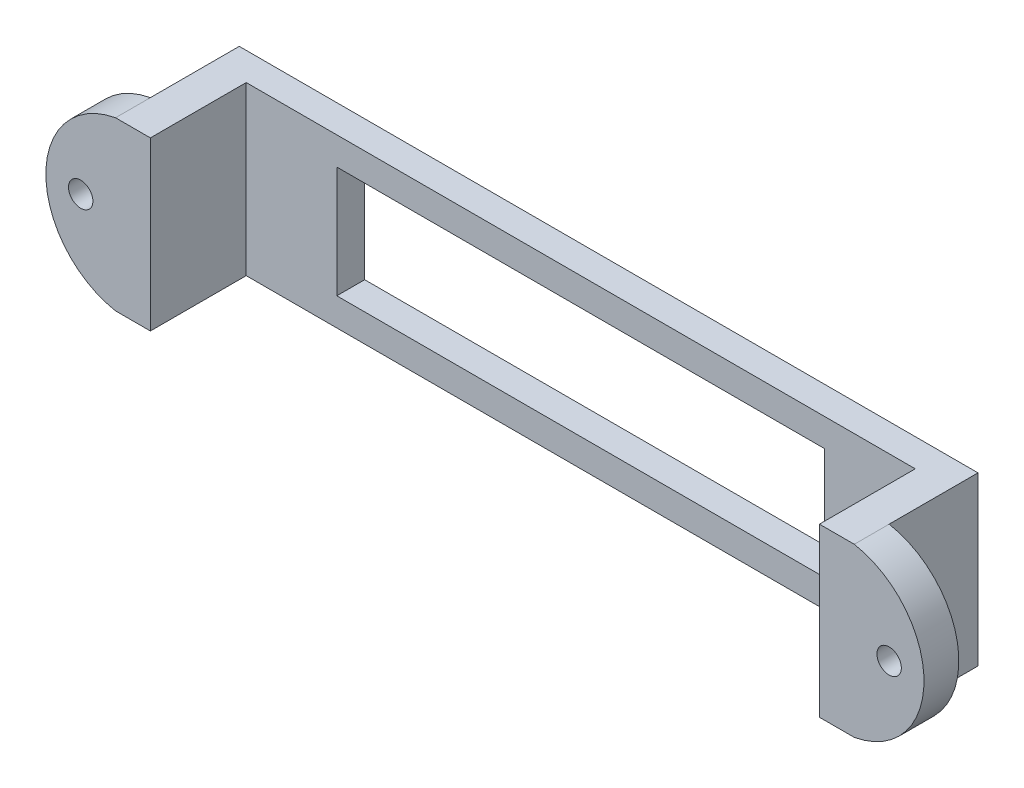
ISO-10303-21;
HEADER;
FILE_DESCRIPTION(('STEP AP214'),'2;1');
FILE_NAME('part.step','',(''),(''),'','','');
FILE_SCHEMA(('AUTOMOTIVE_DESIGN { 1 0 10303 214 1 1 1 1 }'));
ENDSEC;
DATA;
#1=APPLICATION_CONTEXT('core data for automotive mechanical design processes');
#2=APPLICATION_PROTOCOL_DEFINITION('international standard','automotive_design',2000,#1);
#3=PRODUCT_CONTEXT('',#1,'mechanical');
#4=PRODUCT('Part','Part','',(#3));
#5=PRODUCT_RELATED_PRODUCT_CATEGORY('part','',(#4));
#6=PRODUCT_DEFINITION_FORMATION('','',#4);
#7=PRODUCT_DEFINITION_CONTEXT('part definition',#1,'design');
#8=PRODUCT_DEFINITION('design','',#6,#7);
#9=PRODUCT_DEFINITION_SHAPE('','',#8);
#10=(LENGTH_UNIT() NAMED_UNIT(*) SI_UNIT(.MILLI.,.METRE.));
#11=(NAMED_UNIT(*) PLANE_ANGLE_UNIT() SI_UNIT($,.RADIAN.));
#12=(NAMED_UNIT(*) SI_UNIT($,.STERADIAN.) SOLID_ANGLE_UNIT());
#13=UNCERTAINTY_MEASURE_WITH_UNIT(LENGTH_MEASURE(1.E-05),#10,'distance_accuracy_value','');
#14=(GEOMETRIC_REPRESENTATION_CONTEXT(3) GLOBAL_UNCERTAINTY_ASSIGNED_CONTEXT((#13)) GLOBAL_UNIT_ASSIGNED_CONTEXT((#10,
#11,#12)) REPRESENTATION_CONTEXT('',''));
#15=CARTESIAN_POINT('',(0.,0.,0.));
#16=DIRECTION('',(0.,0.,1.));
#17=DIRECTION('',(1.,0.,0.));
#18=AXIS2_PLACEMENT_3D('',#15,#16,#17);
#19=CARTESIAN_POINT('',(0.,0.,4.));
#20=DIRECTION('',(0.,0.,1.));
#21=DIRECTION('',(1.,0.,0.));
#22=AXIS2_PLACEMENT_3D('',#19,#20,#21);
#23=PLANE('',#22);
#24=DIRECTION('',(1.,0.,0.));
#25=VECTOR('',#24,1.);
#26=CARTESIAN_POINT('',(0.,8.,4.));
#27=LINE('',#26,#25);
#28=CARTESIAN_POINT('',(-35.,8.,4.));
#29=VERTEX_POINT('',#28);
#30=CARTESIAN_POINT('',(35.,8.,4.));
#31=VERTEX_POINT('',#30);
#32=EDGE_CURVE('E265',#29,#31,#27,.T.);
#33=ORIENTED_EDGE('',*,*,#32,.T.);
#34=DIRECTION('',(0.,-1.,0.));
#35=VECTOR('',#34,1.);
#36=CARTESIAN_POINT('',(35.,0.,4.));
#37=LINE('',#36,#35);
#38=CARTESIAN_POINT('',(35.,-8.,4.));
#39=VERTEX_POINT('',#38);
#40=EDGE_CURVE('E267',#31,#39,#37,.T.);
#41=ORIENTED_EDGE('',*,*,#40,.T.);
#42=DIRECTION('',(1.,0.,0.));
#43=VECTOR('',#42,1.);
#44=CARTESIAN_POINT('',(0.,-8.,4.));
#45=LINE('',#44,#43);
#46=CARTESIAN_POINT('',(-35.,-8.,4.));
#47=VERTEX_POINT('',#46);
#48=EDGE_CURVE('E273',#47,#39,#45,.T.);
#49=ORIENTED_EDGE('',*,*,#48,.F.);
#50=DIRECTION('',(0.,-1.,0.));
#51=VECTOR('',#50,1.);
#52=CARTESIAN_POINT('',(-35.,0.,4.));
#53=LINE('',#52,#51);
#54=EDGE_CURVE('E232',#29,#47,#53,.T.);
#55=ORIENTED_EDGE('',*,*,#54,.F.);
#56=EDGE_LOOP('',(#33,#41,#49,#55));
#57=FACE_BOUND('',#56,.T.);
#58=DIRECTION('',(1.,0.,0.));
#59=VECTOR('',#58,1.);
#60=CARTESIAN_POINT('',(0.,-12.,4.));
#61=LINE('',#60,#59);
#62=CARTESIAN_POINT('',(-48.,-12.,4.));
#63=VERTEX_POINT('',#62);
#64=CARTESIAN_POINT('',(48.,-12.,4.));
#65=VERTEX_POINT('',#64);
#66=EDGE_CURVE('E61',#63,#65,#61,.T.);
#67=ORIENTED_EDGE('',*,*,#66,.T.);
#68=DIRECTION('',(0.,-1.,0.));
#69=VECTOR('',#68,1.);
#70=CARTESIAN_POINT('',(48.,12.,4.));
#71=LINE('',#70,#69);
#72=CARTESIAN_POINT('',(48.,12.,4.));
#73=VERTEX_POINT('',#72);
#74=EDGE_CURVE('E56',#73,#65,#71,.T.);
#75=ORIENTED_EDGE('',*,*,#74,.F.);
#76=DIRECTION('',(1.,0.,0.));
#77=VECTOR('',#76,1.);
#78=CARTESIAN_POINT('',(0.,12.,4.));
#79=LINE('',#78,#77);
#80=CARTESIAN_POINT('',(-48.,12.,4.));
#81=VERTEX_POINT('',#80);
#82=EDGE_CURVE('E211',#81,#73,#79,.T.);
#83=ORIENTED_EDGE('',*,*,#82,.F.);
#84=DIRECTION('',(0.,1.,0.));
#85=VECTOR('',#84,1.);
#86=CARTESIAN_POINT('',(-48.,12.,4.));
#87=LINE('',#86,#85);
#88=EDGE_CURVE('E198',#63,#81,#87,.T.);
#89=ORIENTED_EDGE('',*,*,#88,.F.);
#90=EDGE_LOOP('',(#67,#75,#83,#89));
#91=FACE_BOUND('',#90,.T.);
#92=ADVANCED_FACE('F39',(#57,#91),#23,.T.);
#93=CARTESIAN_POINT('',(0.,8.,4.));
#94=DIRECTION('',(0.,1.,0.));
#95=DIRECTION('',(0.,0.,1.));
#96=AXIS2_PLACEMENT_3D('',#93,#94,#95);
#97=PLANE('',#96);
#98=DIRECTION('',(1.,0.,0.));
#99=VECTOR('',#98,1.);
#100=CARTESIAN_POINT('',(0.,8.,0.));
#101=LINE('',#100,#99);
#102=CARTESIAN_POINT('',(-35.,8.,0.));
#103=VERTEX_POINT('',#102);
#104=CARTESIAN_POINT('',(35.,8.,0.));
#105=VERTEX_POINT('',#104);
#106=EDGE_CURVE('E240',#103,#105,#101,.T.);
#107=ORIENTED_EDGE('',*,*,#106,.T.);
#108=DIRECTION('',(0.,0.,-1.));
#109=VECTOR('',#108,1.);
#110=CARTESIAN_POINT('',(35.,8.,4.));
#111=LINE('',#110,#109);
#112=EDGE_CURVE('E11',#31,#105,#111,.T.);
#113=ORIENTED_EDGE('',*,*,#112,.F.);
#114=ORIENTED_EDGE('',*,*,#32,.F.);
#115=DIRECTION('',(0.,0.,-1.));
#116=VECTOR('',#115,1.);
#117=CARTESIAN_POINT('',(-35.,8.,4.));
#118=LINE('',#117,#116);
#119=EDGE_CURVE('E252',#29,#103,#118,.T.);
#120=ORIENTED_EDGE('',*,*,#119,.T.);
#121=EDGE_LOOP('',(#107,#113,#114,#120));
#122=FACE_BOUND('',#121,.T.);
#123=ADVANCED_FACE('F292',(#122),#97,.F.);
#124=CARTESIAN_POINT('',(35.,0.,4.));
#125=DIRECTION('',(1.,0.,0.));
#126=DIRECTION('',(0.,0.,-1.));
#127=AXIS2_PLACEMENT_3D('',#124,#125,#126);
#128=PLANE('',#127);
#129=DIRECTION('',(0.,-1.,0.));
#130=VECTOR('',#129,1.);
#131=CARTESIAN_POINT('',(35.,0.,0.));
#132=LINE('',#131,#130);
#133=CARTESIAN_POINT('',(35.,-8.,0.));
#134=VERTEX_POINT('',#133);
#135=EDGE_CURVE('E243',#105,#134,#132,.T.);
#136=ORIENTED_EDGE('',*,*,#135,.T.);
#137=DIRECTION('',(0.,0.,-1.));
#138=VECTOR('',#137,1.);
#139=CARTESIAN_POINT('',(35.,-8.,4.));
#140=LINE('',#139,#138);
#141=EDGE_CURVE('E48',#39,#134,#140,.T.);
#142=ORIENTED_EDGE('',*,*,#141,.F.);
#143=ORIENTED_EDGE('',*,*,#40,.F.);
#144=ORIENTED_EDGE('',*,*,#112,.T.);
#145=EDGE_LOOP('',(#136,#142,#143,#144));
#146=FACE_BOUND('',#145,.T.);
#147=ADVANCED_FACE('F286',(#146),#128,.F.);
#148=CARTESIAN_POINT('',(0.,-8.,4.));
#149=DIRECTION('',(0.,1.,0.));
#150=DIRECTION('',(0.,0.,1.));
#151=AXIS2_PLACEMENT_3D('',#148,#149,#150);
#152=PLANE('',#151);
#153=DIRECTION('',(1.,0.,0.));
#154=VECTOR('',#153,1.);
#155=CARTESIAN_POINT('',(0.,-8.,0.));
#156=LINE('',#155,#154);
#157=CARTESIAN_POINT('',(-35.,-8.,0.));
#158=VERTEX_POINT('',#157);
#159=EDGE_CURVE('E246',#158,#134,#156,.T.);
#160=ORIENTED_EDGE('',*,*,#159,.F.);
#161=DIRECTION('',(0.,0.,-1.));
#162=VECTOR('',#161,1.);
#163=CARTESIAN_POINT('',(-35.,-8.,4.));
#164=LINE('',#163,#162);
#165=EDGE_CURVE('E254',#47,#158,#164,.T.);
#166=ORIENTED_EDGE('',*,*,#165,.F.);
#167=ORIENTED_EDGE('',*,*,#48,.T.);
#168=ORIENTED_EDGE('',*,*,#141,.T.);
#169=EDGE_LOOP('',(#160,#166,#167,#168));
#170=FACE_BOUND('',#169,.T.);
#171=ADVANCED_FACE('F287',(#170),#152,.T.);
#172=CARTESIAN_POINT('',(-53.,0.,4.));
#173=DIRECTION('',(1.,0.,0.));
#174=DIRECTION('',(0.,0.,-1.));
#175=AXIS2_PLACEMENT_3D('',#172,#173,#174);
#176=PLANE('',#175);
#177=DIRECTION('',(0.,-1.,0.));
#178=VECTOR('',#177,1.);
#179=CARTESIAN_POINT('',(-53.,0.,0.));
#180=LINE('',#179,#178);
#181=CARTESIAN_POINT('',(-53.,12.,0.));
#182=VERTEX_POINT('',#181);
#183=CARTESIAN_POINT('',(-53.,-12.,0.));
#184=VERTEX_POINT('',#183);
#185=EDGE_CURVE('E219',#182,#184,#180,.T.);
#186=ORIENTED_EDGE('',*,*,#185,.T.);
#187=DIRECTION('',(0.,0.,-1.));
#188=VECTOR('',#187,1.);
#189=CARTESIAN_POINT('',(-53.,-12.,4.));
#190=LINE('',#189,#188);
#191=CARTESIAN_POINT('',(-53.,-12.,12.75));
#192=VERTEX_POINT('',#191);
#193=EDGE_CURVE('E255',#192,#184,#190,.T.);
#194=ORIENTED_EDGE('',*,*,#193,.F.);
#195=DIRECTION('',(0.,-1.,0.));
#196=VECTOR('',#195,1.);
#197=CARTESIAN_POINT('',(-53.,12.,12.75));
#198=LINE('',#197,#196);
#199=CARTESIAN_POINT('',(-53.,12.,12.75));
#200=VERTEX_POINT('',#199);
#201=EDGE_CURVE('E199',#200,#192,#198,.T.);
#202=ORIENTED_EDGE('',*,*,#201,.F.);
#203=DIRECTION('',(0.,0.,-1.));
#204=VECTOR('',#203,1.);
#205=CARTESIAN_POINT('',(-53.,12.,4.));
#206=LINE('',#205,#204);
#207=EDGE_CURVE('E258',#200,#182,#206,.T.);
#208=ORIENTED_EDGE('',*,*,#207,.T.);
#209=EDGE_LOOP('',(#186,#194,#202,#208));
#210=FACE_BOUND('',#209,.T.);
#211=ADVANCED_FACE('F41',(#210),#176,.F.);
#212=CARTESIAN_POINT('',(0.,-12.,4.));
#213=DIRECTION('',(0.,1.,0.));
#214=DIRECTION('',(0.,0.,1.));
#215=AXIS2_PLACEMENT_3D('',#212,#213,#214);
#216=PLANE('',#215);
#217=DIRECTION('',(1.,0.,0.));
#218=VECTOR('',#217,1.);
#219=CARTESIAN_POINT('',(0.,-12.,0.));
#220=LINE('',#219,#218);
#221=CARTESIAN_POINT('',(53.,-12.,0.));
#222=VERTEX_POINT('',#221);
#223=EDGE_CURVE('E224',#184,#222,#220,.T.);
#224=ORIENTED_EDGE('',*,*,#223,.T.);
#225=DIRECTION('',(0.,0.,-1.));
#226=VECTOR('',#225,1.);
#227=CARTESIAN_POINT('',(53.,-12.,4.));
#228=LINE('',#227,#226);
#229=CARTESIAN_POINT('',(53.,-11.9999999999999,12.75));
#230=VERTEX_POINT('',#229);
#231=EDGE_CURVE('E262',#230,#222,#228,.T.);
#232=ORIENTED_EDGE('',*,*,#231,.F.);
#233=DIRECTION('',(0.,0.,-1.));
#234=VECTOR('',#233,1.);
#235=CARTESIAN_POINT('',(53.,-11.9999999999999,17.75));
#236=LINE('',#235,#234);
#237=CARTESIAN_POINT('',(53.,-11.9999999999999,17.75));
#238=VERTEX_POINT('',#237);
#239=EDGE_CURVE('E167',#238,#230,#236,.T.);
#240=ORIENTED_EDGE('',*,*,#239,.F.);
#241=DIRECTION('',(1.,0.,0.));
#242=VECTOR('',#241,1.);
#243=CARTESIAN_POINT('',(48.,-11.9999999999999,17.75));
#244=LINE('',#243,#242);
#245=CARTESIAN_POINT('',(48.,-11.9999999999999,17.75));
#246=VERTEX_POINT('',#245);
#247=EDGE_CURVE('E158',#246,#238,#244,.T.);
#248=ORIENTED_EDGE('',*,*,#247,.F.);
#249=DIRECTION('',(0.,0.,-1.));
#250=VECTOR('',#249,1.);
#251=CARTESIAN_POINT('',(48.,-12.,12.75));
#252=LINE('',#251,#250);
#253=EDGE_CURVE('E193',#246,#65,#252,.T.);
#254=ORIENTED_EDGE('',*,*,#253,.T.);
#255=ORIENTED_EDGE('',*,*,#66,.F.);
#256=DIRECTION('',(0.,0.,-1.));
#257=VECTOR('',#256,1.);
#258=CARTESIAN_POINT('',(-48.,-12.,12.75));
#259=LINE('',#258,#257);
#260=CARTESIAN_POINT('',(-48.,-12.,17.75));
#261=VERTEX_POINT('',#260);
#262=EDGE_CURVE('E215',#261,#63,#259,.T.);
#263=ORIENTED_EDGE('',*,*,#262,.F.);
#264=DIRECTION('',(1.,0.,0.));
#265=VECTOR('',#264,1.);
#266=CARTESIAN_POINT('',(-48.,-12.,17.75));
#267=LINE('',#266,#265);
#268=CARTESIAN_POINT('',(-53.,-12.,17.75));
#269=VERTEX_POINT('',#268);
#270=EDGE_CURVE('E181',#269,#261,#267,.T.);
#271=ORIENTED_EDGE('',*,*,#270,.F.);
#272=DIRECTION('',(0.,0.,-1.));
#273=VECTOR('',#272,1.);
#274=CARTESIAN_POINT('',(-53.,-12.,17.75));
#275=LINE('',#274,#273);
#276=EDGE_CURVE('E183',#269,#192,#275,.T.);
#277=ORIENTED_EDGE('',*,*,#276,.T.);
#278=ORIENTED_EDGE('',*,*,#193,.T.);
#279=EDGE_LOOP('',(#224,#232,#240,#248,#254,#255,#263,#271,#277,#278));
#280=FACE_BOUND('',#279,.T.);
#281=ADVANCED_FACE('F307',(#280),#216,.F.);
#282=CARTESIAN_POINT('',(53.,0.,4.));
#283=DIRECTION('',(1.,0.,0.));
#284=DIRECTION('',(0.,0.,-1.));
#285=AXIS2_PLACEMENT_3D('',#282,#283,#284);
#286=PLANE('',#285);
#287=DIRECTION('',(0.,-1.,0.));
#288=VECTOR('',#287,1.);
#289=CARTESIAN_POINT('',(53.,0.,0.));
#290=LINE('',#289,#288);
#291=CARTESIAN_POINT('',(53.,12.,0.));
#292=VERTEX_POINT('',#291);
#293=EDGE_CURVE('E229',#292,#222,#290,.T.);
#294=ORIENTED_EDGE('',*,*,#293,.F.);
#295=DIRECTION('',(0.,0.,-1.));
#296=VECTOR('',#295,1.);
#297=CARTESIAN_POINT('',(53.,12.,4.));
#298=LINE('',#297,#296);
#299=CARTESIAN_POINT('',(53.,12.,12.75));
#300=VERTEX_POINT('',#299);
#301=EDGE_CURVE('E260',#300,#292,#298,.T.);
#302=ORIENTED_EDGE('',*,*,#301,.F.);
#303=DIRECTION('',(0.,1.,0.));
#304=VECTOR('',#303,1.);
#305=CARTESIAN_POINT('',(53.,12.,12.75));
#306=LINE('',#305,#304);
#307=EDGE_CURVE('E190',#230,#300,#306,.T.);
#308=ORIENTED_EDGE('',*,*,#307,.F.);
#309=ORIENTED_EDGE('',*,*,#231,.T.);
#310=EDGE_LOOP('',(#294,#302,#308,#309));
#311=FACE_BOUND('',#310,.T.);
#312=ADVANCED_FACE('F305',(#311),#286,.T.);
#313=CARTESIAN_POINT('',(0.,12.,4.));
#314=DIRECTION('',(0.,1.,0.));
#315=DIRECTION('',(0.,0.,1.));
#316=AXIS2_PLACEMENT_3D('',#313,#314,#315);
#317=PLANE('',#316);
#318=DIRECTION('',(1.,0.,0.));
#319=VECTOR('',#318,1.);
#320=CARTESIAN_POINT('',(0.,12.,0.));
#321=LINE('',#320,#319);
#322=EDGE_CURVE('E237',#182,#292,#321,.T.);
#323=ORIENTED_EDGE('',*,*,#322,.F.);
#324=ORIENTED_EDGE('',*,*,#207,.F.);
#325=DIRECTION('',(0.,0.,-1.));
#326=VECTOR('',#325,1.);
#327=CARTESIAN_POINT('',(-53.,12.,17.75));
#328=LINE('',#327,#326);
#329=CARTESIAN_POINT('',(-53.,12.,17.75));
#330=VERTEX_POINT('',#329);
#331=EDGE_CURVE('E187',#330,#200,#328,.T.);
#332=ORIENTED_EDGE('',*,*,#331,.F.);
#333=DIRECTION('',(-1.,0.,0.));
#334=VECTOR('',#333,1.);
#335=CARTESIAN_POINT('',(-48.,12.,17.75));
#336=LINE('',#335,#334);
#337=CARTESIAN_POINT('',(-48.,12.,17.75));
#338=VERTEX_POINT('',#337);
#339=EDGE_CURVE('E177',#338,#330,#336,.T.);
#340=ORIENTED_EDGE('',*,*,#339,.F.);
#341=DIRECTION('',(0.,0.,-1.));
#342=VECTOR('',#341,1.);
#343=CARTESIAN_POINT('',(-48.,12.,12.75));
#344=LINE('',#343,#342);
#345=EDGE_CURVE('E202',#338,#81,#344,.T.);
#346=ORIENTED_EDGE('',*,*,#345,.T.);
#347=ORIENTED_EDGE('',*,*,#82,.T.);
#348=DIRECTION('',(0.,0.,-1.));
#349=VECTOR('',#348,1.);
#350=CARTESIAN_POINT('',(48.,12.,12.75));
#351=LINE('',#350,#349);
#352=CARTESIAN_POINT('',(48.,12.0000000000001,17.75));
#353=VERTEX_POINT('',#352);
#354=EDGE_CURVE('E148',#353,#73,#351,.T.);
#355=ORIENTED_EDGE('',*,*,#354,.F.);
#356=DIRECTION('',(-1.,0.,0.));
#357=VECTOR('',#356,1.);
#358=CARTESIAN_POINT('',(48.,12.0000000000001,17.75));
#359=LINE('',#358,#357);
#360=CARTESIAN_POINT('',(53.,12.0000000000001,17.75));
#361=VERTEX_POINT('',#360);
#362=EDGE_CURVE('E140',#361,#353,#359,.T.);
#363=ORIENTED_EDGE('',*,*,#362,.F.);
#364=DIRECTION('',(0.,0.,-1.));
#365=VECTOR('',#364,1.);
#366=CARTESIAN_POINT('',(53.,12.0000000000001,17.75));
#367=LINE('',#366,#365);
#368=EDGE_CURVE('E145',#361,#300,#367,.T.);
#369=ORIENTED_EDGE('',*,*,#368,.T.);
#370=ORIENTED_EDGE('',*,*,#301,.T.);
#371=EDGE_LOOP('',(#323,#324,#332,#340,#346,#347,#355,#363,#369,#370));
#372=FACE_BOUND('',#371,.T.);
#373=ADVANCED_FACE('F143',(#372),#317,.T.);
#374=CARTESIAN_POINT('',(-35.,0.,4.));
#375=DIRECTION('',(1.,0.,0.));
#376=DIRECTION('',(0.,0.,-1.));
#377=AXIS2_PLACEMENT_3D('',#374,#375,#376);
#378=PLANE('',#377);
#379=DIRECTION('',(0.,-1.,0.));
#380=VECTOR('',#379,1.);
#381=CARTESIAN_POINT('',(-35.,0.,0.));
#382=LINE('',#381,#380);
#383=EDGE_CURVE('E249',#103,#158,#382,.T.);
#384=ORIENTED_EDGE('',*,*,#383,.F.);
#385=ORIENTED_EDGE('',*,*,#119,.F.);
#386=ORIENTED_EDGE('',*,*,#54,.T.);
#387=ORIENTED_EDGE('',*,*,#165,.T.);
#388=EDGE_LOOP('',(#384,#385,#386,#387));
#389=FACE_BOUND('',#388,.T.);
#390=ADVANCED_FACE('F282',(#389),#378,.T.);
#391=CARTESIAN_POINT('',(0.,0.,0.));
#392=DIRECTION('',(0.,0.,1.));
#393=DIRECTION('',(1.,0.,0.));
#394=AXIS2_PLACEMENT_3D('',#391,#392,#393);
#395=PLANE('',#394);
#396=ORIENTED_EDGE('',*,*,#185,.F.);
#397=ORIENTED_EDGE('',*,*,#322,.T.);
#398=ORIENTED_EDGE('',*,*,#293,.T.);
#399=ORIENTED_EDGE('',*,*,#223,.F.);
#400=EDGE_LOOP('',(#396,#397,#398,#399));
#401=FACE_BOUND('',#400,.T.);
#402=ORIENTED_EDGE('',*,*,#106,.F.);
#403=ORIENTED_EDGE('',*,*,#383,.T.);
#404=ORIENTED_EDGE('',*,*,#159,.T.);
#405=ORIENTED_EDGE('',*,*,#135,.F.);
#406=EDGE_LOOP('',(#402,#403,#404,#405));
#407=FACE_BOUND('',#406,.T.);
#408=ADVANCED_FACE('F290',(#401,#407),#395,.F.);
#409=CARTESIAN_POINT('',(-48.,12.,12.75));
#410=DIRECTION('',(-1.,0.,0.));
#411=DIRECTION('',(0.,0.,1.));
#412=AXIS2_PLACEMENT_3D('',#409,#410,#411);
#413=PLANE('',#412);
#414=ORIENTED_EDGE('',*,*,#88,.T.);
#415=ORIENTED_EDGE('',*,*,#345,.F.);
#416=DIRECTION('',(0.,1.,0.));
#417=VECTOR('',#416,1.);
#418=CARTESIAN_POINT('',(-48.,12.,17.75));
#419=LINE('',#418,#417);
#420=EDGE_CURVE('E170',#261,#338,#419,.T.);
#421=ORIENTED_EDGE('',*,*,#420,.F.);
#422=ORIENTED_EDGE('',*,*,#262,.T.);
#423=EDGE_LOOP('',(#414,#415,#421,#422));
#424=FACE_BOUND('',#423,.T.);
#425=ADVANCED_FACE('F366',(#424),#413,.F.);
#426=CARTESIAN_POINT('',(48.,12.,12.75));
#427=DIRECTION('',(1.,0.,0.));
#428=DIRECTION('',(0.,0.,-1.));
#429=AXIS2_PLACEMENT_3D('',#426,#427,#428);
#430=PLANE('',#429);
#431=ORIENTED_EDGE('',*,*,#74,.T.);
#432=ORIENTED_EDGE('',*,*,#253,.F.);
#433=DIRECTION('',(0.,-1.,0.));
#434=VECTOR('',#433,1.);
#435=CARTESIAN_POINT('',(48.,12.0000000000001,17.75));
#436=LINE('',#435,#434);
#437=EDGE_CURVE('E152',#353,#246,#436,.T.);
#438=ORIENTED_EDGE('',*,*,#437,.F.);
#439=ORIENTED_EDGE('',*,*,#354,.T.);
#440=EDGE_LOOP('',(#431,#432,#438,#439));
#441=FACE_BOUND('',#440,.T.);
#442=ADVANCED_FACE('F359',(#441),#430,.F.);
#443=CARTESIAN_POINT('',(-50.8,0.,12.75));
#444=DIRECTION('',(0.,0.,1.));
#445=DIRECTION('',(1.,0.,0.));
#446=AXIS2_PLACEMENT_3D('',#443,#444,#445);
#447=PLANE('',#446);
#448=CARTESIAN_POINT('',(-58.,0.,12.75));
#449=DIRECTION('',(0.,0.,1.));
#450=DIRECTION('',(1.,0.,0.));
#451=AXIS2_PLACEMENT_3D('',#448,#449,#450);
#452=CIRCLE('',#451,1.75);
#453=CARTESIAN_POINT('',(-56.25,0.,12.75));
#454=VERTEX_POINT('',#453);
#455=EDGE_CURVE('E319',#454,#454,#452,.T.);
#456=ORIENTED_EDGE('',*,*,#455,.T.);
#457=EDGE_LOOP('',(#456));
#458=FACE_BOUND('',#457,.T.);
#459=CARTESIAN_POINT('',(-50.8,0.,12.75));
#460=DIRECTION('',(0.,0.,1.));
#461=DIRECTION('',(1.,0.,0.));
#462=AXIS2_PLACEMENT_3D('',#459,#460,#461);
#463=CIRCLE('',#462,12.2);
#464=EDGE_CURVE('E166',#200,#192,#463,.T.);
#465=ORIENTED_EDGE('',*,*,#464,.F.);
#466=ORIENTED_EDGE('',*,*,#201,.T.);
#467=EDGE_LOOP('',(#465,#466));
#468=FACE_BOUND('',#467,.T.);
#469=ADVANCED_FACE('F356',(#458,#468),#447,.F.);
#470=CARTESIAN_POINT('',(-50.8,0.,17.75));
#471=DIRECTION('',(0.,0.,-1.));
#472=DIRECTION('',(-1.,0.,0.));
#473=AXIS2_PLACEMENT_3D('',#470,#471,#472);
#474=CYLINDRICAL_SURFACE('',#473,12.2);
#475=ORIENTED_EDGE('',*,*,#464,.T.);
#476=ORIENTED_EDGE('',*,*,#276,.F.);
#477=CARTESIAN_POINT('',(-50.8,0.,17.75));
#478=DIRECTION('',(0.,0.,1.));
#479=DIRECTION('',(1.,0.,0.));
#480=AXIS2_PLACEMENT_3D('',#477,#478,#479);
#481=CIRCLE('',#480,12.2);
#482=EDGE_CURVE('E179',#330,#269,#481,.T.);
#483=ORIENTED_EDGE('',*,*,#482,.F.);
#484=ORIENTED_EDGE('',*,*,#331,.T.);
#485=EDGE_LOOP('',(#475,#476,#483,#484));
#486=FACE_BOUND('',#485,.T.);
#487=ADVANCED_FACE('F354',(#486),#474,.T.);
#488=CARTESIAN_POINT('',(-50.8,0.,17.75));
#489=DIRECTION('',(0.,0.,1.));
#490=DIRECTION('',(1.,0.,0.));
#491=AXIS2_PLACEMENT_3D('',#488,#489,#490);
#492=PLANE('',#491);
#493=CARTESIAN_POINT('',(-58.,0.,17.75));
#494=DIRECTION('',(0.,0.,1.));
#495=DIRECTION('',(1.,0.,0.));
#496=AXIS2_PLACEMENT_3D('',#493,#494,#495);
#497=CIRCLE('',#496,1.75);
#498=CARTESIAN_POINT('',(-56.25,0.,17.75));
#499=VERTEX_POINT('',#498);
#500=EDGE_CURVE('E321',#499,#499,#497,.T.);
#501=ORIENTED_EDGE('',*,*,#500,.F.);
#502=EDGE_LOOP('',(#501));
#503=FACE_BOUND('',#502,.T.);
#504=ORIENTED_EDGE('',*,*,#420,.T.);
#505=ORIENTED_EDGE('',*,*,#339,.T.);
#506=ORIENTED_EDGE('',*,*,#482,.T.);
#507=ORIENTED_EDGE('',*,*,#270,.T.);
#508=EDGE_LOOP('',(#504,#505,#506,#507));
#509=FACE_BOUND('',#508,.T.);
#510=ADVANCED_FACE('F351',(#503,#509),#492,.T.);
#511=CARTESIAN_POINT('',(50.8,1.35308431126191E-13,17.75));
#512=DIRECTION('',(0.,0.,-1.));
#513=DIRECTION('',(-1.,0.,0.));
#514=AXIS2_PLACEMENT_3D('',#511,#512,#513);
#515=CYLINDRICAL_SURFACE('',#514,12.2);
#516=CARTESIAN_POINT('',(50.8,1.35308431126191E-13,12.75));
#517=DIRECTION('',(0.,0.,1.));
#518=DIRECTION('',(-1.,0.,0.));
#519=AXIS2_PLACEMENT_3D('',#516,#517,#518);
#520=CIRCLE('',#519,12.2);
#521=EDGE_CURVE('E162',#230,#300,#520,.T.);
#522=ORIENTED_EDGE('',*,*,#521,.T.);
#523=ORIENTED_EDGE('',*,*,#368,.F.);
#524=CARTESIAN_POINT('',(50.8,1.35308431126191E-13,17.75));
#525=DIRECTION('',(0.,0.,1.));
#526=DIRECTION('',(-1.,0.,0.));
#527=AXIS2_PLACEMENT_3D('',#524,#525,#526);
#528=CIRCLE('',#527,12.2);
#529=EDGE_CURVE('E153',#238,#361,#528,.T.);
#530=ORIENTED_EDGE('',*,*,#529,.F.);
#531=ORIENTED_EDGE('',*,*,#239,.T.);
#532=EDGE_LOOP('',(#522,#523,#530,#531));
#533=FACE_BOUND('',#532,.T.);
#534=ADVANCED_FACE('F164',(#533),#515,.T.);
#535=CARTESIAN_POINT('',(50.8,1.35308431126191E-13,17.75));
#536=DIRECTION('',(0.,0.,-1.));
#537=DIRECTION('',(-1.,0.,0.));
#538=AXIS2_PLACEMENT_3D('',#535,#536,#537);
#539=PLANE('',#538);
#540=CARTESIAN_POINT('',(58.,0.,17.75));
#541=DIRECTION('',(0.,0.,1.));
#542=DIRECTION('',(-1.,0.,0.));
#543=AXIS2_PLACEMENT_3D('',#540,#541,#542);
#544=CIRCLE('',#543,1.75);
#545=CARTESIAN_POINT('',(56.25,0.,17.75));
#546=VERTEX_POINT('',#545);
#547=EDGE_CURVE('E328',#546,#546,#544,.T.);
#548=ORIENTED_EDGE('',*,*,#547,.F.);
#549=EDGE_LOOP('',(#548));
#550=FACE_BOUND('',#549,.T.);
#551=ORIENTED_EDGE('',*,*,#529,.T.);
#552=ORIENTED_EDGE('',*,*,#362,.T.);
#553=ORIENTED_EDGE('',*,*,#437,.T.);
#554=ORIENTED_EDGE('',*,*,#247,.T.);
#555=EDGE_LOOP('',(#551,#552,#553,#554));
#556=FACE_BOUND('',#555,.T.);
#557=ADVANCED_FACE('F156',(#550,#556),#539,.F.);
#558=CARTESIAN_POINT('',(50.8,1.35308431126191E-13,12.75));
#559=DIRECTION('',(0.,0.,-1.));
#560=DIRECTION('',(-1.,0.,0.));
#561=AXIS2_PLACEMENT_3D('',#558,#559,#560);
#562=PLANE('',#561);
#563=CARTESIAN_POINT('',(58.,0.,12.75));
#564=DIRECTION('',(0.,0.,-1.));
#565=DIRECTION('',(-1.,0.,0.));
#566=AXIS2_PLACEMENT_3D('',#563,#564,#565);
#567=CIRCLE('',#566,1.75);
#568=CARTESIAN_POINT('',(56.25,0.,12.75));
#569=VERTEX_POINT('',#568);
#570=EDGE_CURVE('E43',#569,#569,#567,.T.);
#571=ORIENTED_EDGE('',*,*,#570,.F.);
#572=EDGE_LOOP('',(#571));
#573=FACE_BOUND('',#572,.T.);
#574=ORIENTED_EDGE('',*,*,#521,.F.);
#575=ORIENTED_EDGE('',*,*,#307,.T.);
#576=EDGE_LOOP('',(#574,#575));
#577=FACE_BOUND('',#576,.T.);
#578=ADVANCED_FACE('F318',(#573,#577),#562,.T.);
#579=CARTESIAN_POINT('',(-58.,0.,0.));
#580=DIRECTION('',(0.,0.,1.));
#581=DIRECTION('',(1.,0.,0.));
#582=AXIS2_PLACEMENT_3D('',#579,#580,#581);
#583=CYLINDRICAL_SURFACE('',#582,1.75);
#584=ORIENTED_EDGE('',*,*,#500,.T.);
#585=EDGE_LOOP('',(#584));
#586=FACE_BOUND('',#585,.T.);
#587=ORIENTED_EDGE('',*,*,#455,.F.);
#588=EDGE_LOOP('',(#587));
#589=FACE_BOUND('',#588,.T.);
#590=ADVANCED_FACE('F338',(#586,#589),#583,.F.);
#591=CARTESIAN_POINT('',(58.,0.,0.));
#592=DIRECTION('',(0.,0.,1.));
#593=DIRECTION('',(1.,0.,0.));
#594=AXIS2_PLACEMENT_3D('',#591,#592,#593);
#595=CYLINDRICAL_SURFACE('',#594,1.75);
#596=ORIENTED_EDGE('',*,*,#570,.T.);
#597=EDGE_LOOP('',(#596));
#598=FACE_BOUND('',#597,.T.);
#599=ORIENTED_EDGE('',*,*,#547,.T.);
#600=EDGE_LOOP('',(#599));
#601=FACE_BOUND('',#600,.T.);
#602=ADVANCED_FACE('F335',(#598,#601),#595,.F.);
#603=CLOSED_SHELL('',(#92,#123,#147,#171,#211,#281,#312,#373,#390,#408,#425,#442,#469,#487,#510,
#534,#557,#578,#590,#602));
#604=MANIFOLD_SOLID_BREP('B2',#603);
#605=ADVANCED_BREP_SHAPE_REPRESENTATION('',(#18,#604),#14);
#606=SHAPE_DEFINITION_REPRESENTATION(#9,#605);
ENDSEC;
END-ISO-10303-21;
